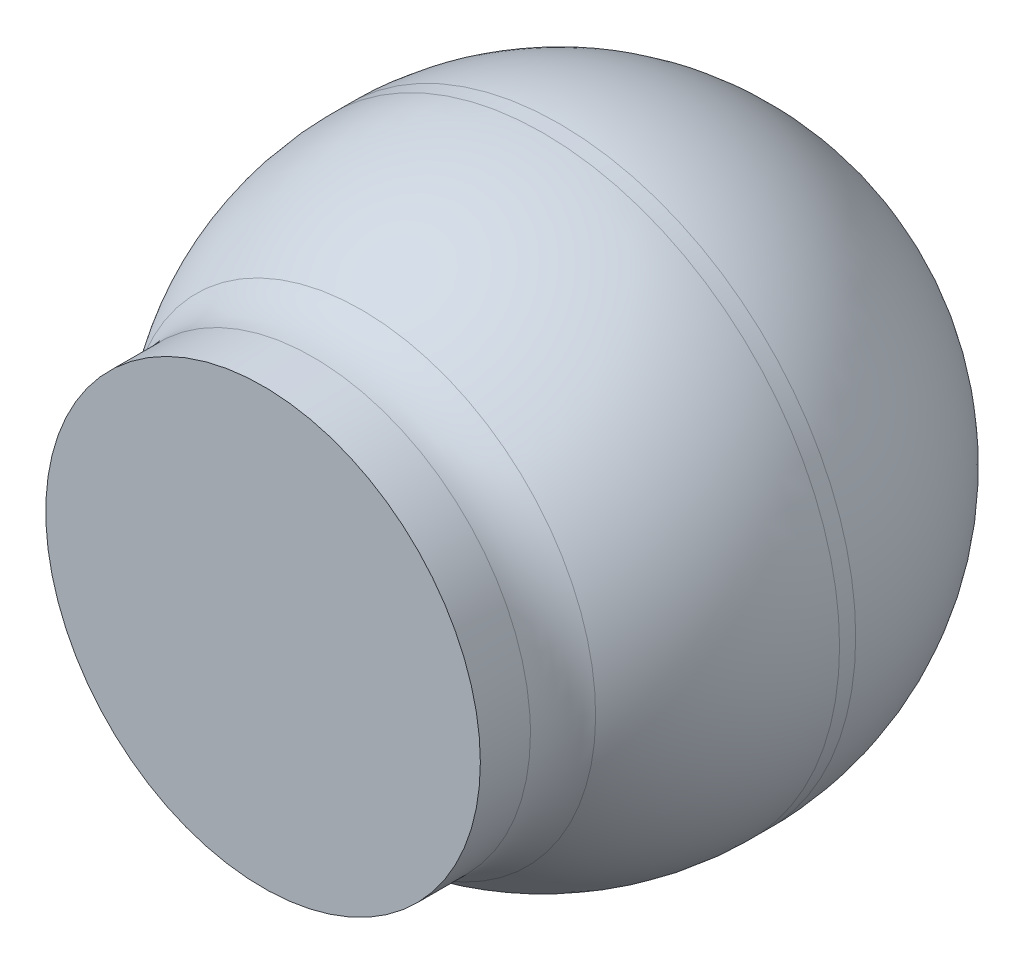
ISO-10303-21;
HEADER;
FILE_DESCRIPTION(('STEP AP214'),'2;1');
FILE_NAME('part.step','',(''),(''),'','','');
FILE_SCHEMA(('AUTOMOTIVE_DESIGN { 1 0 10303 214 1 1 1 1 }'));
ENDSEC;
DATA;
#1=APPLICATION_CONTEXT('core data for automotive mechanical design processes');
#2=APPLICATION_PROTOCOL_DEFINITION('international standard','automotive_design',2000,#1);
#3=PRODUCT_CONTEXT('',#1,'mechanical');
#4=PRODUCT('Part','Part','',(#3));
#5=PRODUCT_RELATED_PRODUCT_CATEGORY('part','',(#4));
#6=PRODUCT_DEFINITION_FORMATION('','',#4);
#7=PRODUCT_DEFINITION_CONTEXT('part definition',#1,'design');
#8=PRODUCT_DEFINITION('design','',#6,#7);
#9=PRODUCT_DEFINITION_SHAPE('','',#8);
#10=(LENGTH_UNIT() NAMED_UNIT(*) SI_UNIT(.MILLI.,.METRE.));
#11=(NAMED_UNIT(*) PLANE_ANGLE_UNIT() SI_UNIT($,.RADIAN.));
#12=(NAMED_UNIT(*) SI_UNIT($,.STERADIAN.) SOLID_ANGLE_UNIT());
#13=UNCERTAINTY_MEASURE_WITH_UNIT(LENGTH_MEASURE(1.E-05),#10,'distance_accuracy_value','');
#14=(GEOMETRIC_REPRESENTATION_CONTEXT(3) GLOBAL_UNCERTAINTY_ASSIGNED_CONTEXT((#13)) GLOBAL_UNIT_ASSIGNED_CONTEXT((#10,
#11,#12)) REPRESENTATION_CONTEXT('',''));
#15=CARTESIAN_POINT('',(0.,0.,0.));
#16=DIRECTION('',(0.,0.,1.));
#17=DIRECTION('',(1.,0.,0.));
#18=AXIS2_PLACEMENT_3D('',#15,#16,#17);
#19=CARTESIAN_POINT('',(-0.562919922269,-11.67134929145,10.006534503384));
#20=DIRECTION('',(0.,0.,-1.));
#21=DIRECTION('',(-1.,0.,0.));
#22=AXIS2_PLACEMENT_3D('',#19,#20,#21);
#23=PLANE('',#22);
#24=CARTESIAN_POINT('',(-0.562919922269,-11.67134929145,10.006534503384));
#25=DIRECTION('',(0.,0.,1.));
#26=DIRECTION('',(1.,0.,0.));
#27=AXIS2_PLACEMENT_3D('',#24,#25,#26);
#28=CIRCLE('',#27,0.275);
#29=CARTESIAN_POINT('',(-0.287919922269,-11.67134929145,10.006534503384));
#30=VERTEX_POINT('',#29);
#31=EDGE_CURVE('E20',#30,#30,#28,.F.);
#32=ORIENTED_EDGE('',*,*,#31,.F.);
#33=EDGE_LOOP('',(#32));
#34=FACE_BOUND('',#33,.T.);
#35=ADVANCED_FACE('F17',(#34),#23,.F.);
#36=CARTESIAN_POINT('',(-0.562919922269,-11.67134929145,9.906534503384));
#37=DIRECTION('',(0.,0.,1.));
#38=DIRECTION('',(1.,0.,0.));
#39=AXIS2_PLACEMENT_3D('',#36,#37,#38);
#40=CYLINDRICAL_SURFACE('',#39,0.275);
#41=CARTESIAN_POINT('',(-0.562919922269,-11.67134929145,9.943180457728));
#42=DIRECTION('',(0.,0.,-1.));
#43=DIRECTION('',(0.996700902337582,0.081162252799247,0.));
#44=AXIS2_PLACEMENT_3D('',#41,#42,#43);
#45=CIRCLE('',#44,0.275);
#46=CARTESIAN_POINT('',(-0.288827174126165,-11.6490296719302,9.943180457728));
#47=VERTEX_POINT('',#46);
#48=EDGE_CURVE('E66',#47,#47,#45,.F.);
#49=ORIENTED_EDGE('',*,*,#48,.T.);
#50=EDGE_LOOP('',(#49));
#51=FACE_BOUND('',#50,.T.);
#52=ORIENTED_EDGE('',*,*,#31,.T.);
#53=EDGE_LOOP('',(#52));
#54=FACE_BOUND('',#53,.T.);
#55=ADVANCED_FACE('F62',(#51,#54),#40,.T.);
#56=CARTESIAN_POINT('',(-0.562919922269,-11.67134929145,9.943180457728));
#57=DIRECTION('',(0.,0.,-1.));
#58=DIRECTION('',(0.996700902337583,0.0811622527992449,0.));
#59=AXIS2_PLACEMENT_3D('',#56,#57,#58);
#60=TOROIDAL_SURFACE('',#59,0.375,0.1);
#61=ORIENTED_EDGE('',*,*,#48,.F.);
#62=EDGE_LOOP('',(#61));
#63=FACE_BOUND('',#62,.T.);
#64=CARTESIAN_POINT('',(-0.562919922268999,-11.67134929145,9.881744931236));
#65=DIRECTION('',(0.,0.,-1.));
#66=DIRECTION('',(-0.996700902338691,-0.0811622527856354,0.));
#67=AXIS2_PLACEMENT_3D('',#64,#65,#66);
#68=CIRCLE('',#67,0.29609704641234);
#69=CARTESIAN_POINT('',(-0.858040115608,-11.69538119478,9.881744931236));
#70=VERTEX_POINT('',#69);
#71=EDGE_CURVE('E39',#70,#70,#68,.T.);
#72=ORIENTED_EDGE('',*,*,#71,.F.);
#73=EDGE_LOOP('',(#72));
#74=FACE_BOUND('',#73,.T.);
#75=ADVANCED_FACE('F57',(#63,#74),#60,.F.);
#76=CARTESIAN_POINT('',(-0.936682760645,-11.70178513625,9.651976062157));
#77=CARTESIAN_POINT('',(-0.936682760645,-11.70178513625,9.701461392103));
#78=CARTESIAN_POINT('',(-0.928526217348,-11.70112094157,9.750947004335));
#79=CARTESIAN_POINT('',(-0.912207085349,-11.69979205995,9.798626332798));
#80=CARTESIAN_POINT('',(-0.888341390838,-11.69784865493,9.842699544317));
#81=CARTESIAN_POINT('',(-0.858040115608,-11.69538119478,9.881744931236));
#82=(BOUNDED_CURVE() B_SPLINE_CURVE(5,(#76,#77,#78,#79,#80,#81),.UNSPECIFIED.,.F.,
.F.) B_SPLINE_CURVE_WITH_KNOTS((6,6),(0.,0.661568582165),
.UNSPECIFIED.) CURVE() GEOMETRIC_REPRESENTATION_ITEM() RATIONAL_B_SPLINE_CURVE((1.,1.,1.,1.,1.,1.)) REPRESENTATION_ITEM(''));
#83=CARTESIAN_POINT('',(-0.562919922269,-11.67134929145,9.651976062157));
#84=DIRECTION('',(0.,0.,-1.));
#85=AXIS1_PLACEMENT('',#83,#84);
#86=SURFACE_OF_REVOLUTION('',#82,#85);
#87=CARTESIAN_POINT('',(-0.562919922268999,-11.67134929145,9.651976062157));
#88=DIRECTION('',(0.,0.,1.));
#89=DIRECTION('',(1.,0.,0.));
#90=AXIS2_PLACEMENT_3D('',#87,#88,#89);
#91=CIRCLE('',#90,0.375);
#92=CARTESIAN_POINT('',(-0.187919922268999,-11.67134929145,9.651976062157));
#93=VERTEX_POINT('',#92);
#94=EDGE_CURVE('E36',#93,#93,#91,.F.);
#95=ORIENTED_EDGE('',*,*,#94,.F.);
#96=EDGE_LOOP('',(#95));
#97=FACE_BOUND('',#96,.T.);
#98=ORIENTED_EDGE('',*,*,#71,.T.);
#99=EDGE_LOOP('',(#98));
#100=FACE_BOUND('',#99,.T.);
#101=ADVANCED_FACE('F53',(#97,#100),#86,.F.);
#102=CARTESIAN_POINT('',(-0.562919922269,-11.67134929145,9.256534503384));
#103=DIRECTION('',(0.,0.,1.));
#104=DIRECTION('',(1.,0.,0.));
#105=AXIS2_PLACEMENT_3D('',#102,#103,#104);
#106=CYLINDRICAL_SURFACE('',#105,0.375);
#107=CARTESIAN_POINT('',(-0.562919922269,-11.67134929145,9.631534503384));
#108=DIRECTION('',(0.,0.,-1.));
#109=DIRECTION('',(0.0811622527992362,-0.996700902337583,0.));
#110=AXIS2_PLACEMENT_3D('',#107,#108,#109);
#111=CIRCLE('',#110,0.375);
#112=CARTESIAN_POINT('',(-0.532484077469286,-12.0451121298266,9.631534503384));
#113=VERTEX_POINT('',#112);
#114=CARTESIAN_POINT('',(-0.593355767068713,-11.2975864530734,9.631534503384));
#115=VERTEX_POINT('',#114);
#116=EDGE_CURVE('E11',#113,#115,#111,.T.);
#117=ORIENTED_EDGE('',*,*,#116,.F.);
#118=CARTESIAN_POINT('',(-0.562919922269,-11.67134929145,9.631534503384));
#119=DIRECTION('',(3.33436315446763E-12,2.72100352061447E-13,1.));
#120=DIRECTION('',(0.0811622527992359,-0.996700902337583,0.));
#121=AXIS2_PLACEMENT_3D('',#118,#119,#120);
#122=CIRCLE('',#121,0.375);
#123=EDGE_CURVE('E25',#115,#113,#122,.F.);
#124=ORIENTED_EDGE('',*,*,#123,.F.);
#125=EDGE_LOOP('',(#117,#124));
#126=FACE_BOUND('',#125,.T.);
#127=ORIENTED_EDGE('',*,*,#94,.T.);
#128=EDGE_LOOP('',(#127));
#129=FACE_BOUND('',#128,.T.);
#130=ADVANCED_FACE('F34',(#126,#129),#106,.T.);
#131=CARTESIAN_POINT('',(-0.562919922269,-11.67134929145,9.631534503384));
#132=DIRECTION('',(0.0811622527992361,-0.996700902337583,0.));
#133=DIRECTION('',(-0.996700902337583,-0.0811622527992361,0.));
#134=AXIS2_PLACEMENT_3D('',#131,#132,#133);
#135=SPHERICAL_SURFACE('',#134,0.375);
#136=ORIENTED_EDGE('',*,*,#123,.T.);
#137=ORIENTED_EDGE('',*,*,#116,.T.);
#138=EDGE_LOOP('',(#136,#137));
#139=FACE_BOUND('',#138,.T.);
#140=ADVANCED_FACE('F32',(#139),#135,.T.);
#141=CLOSED_SHELL('',(#35,#55,#75,#101,#130,#140));
#142=MANIFOLD_SOLID_BREP('B1',#141);
#143=ADVANCED_BREP_SHAPE_REPRESENTATION('',(#18,#142),#14);
#144=SHAPE_DEFINITION_REPRESENTATION(#9,#143);
ENDSEC;
END-ISO-10303-21;
